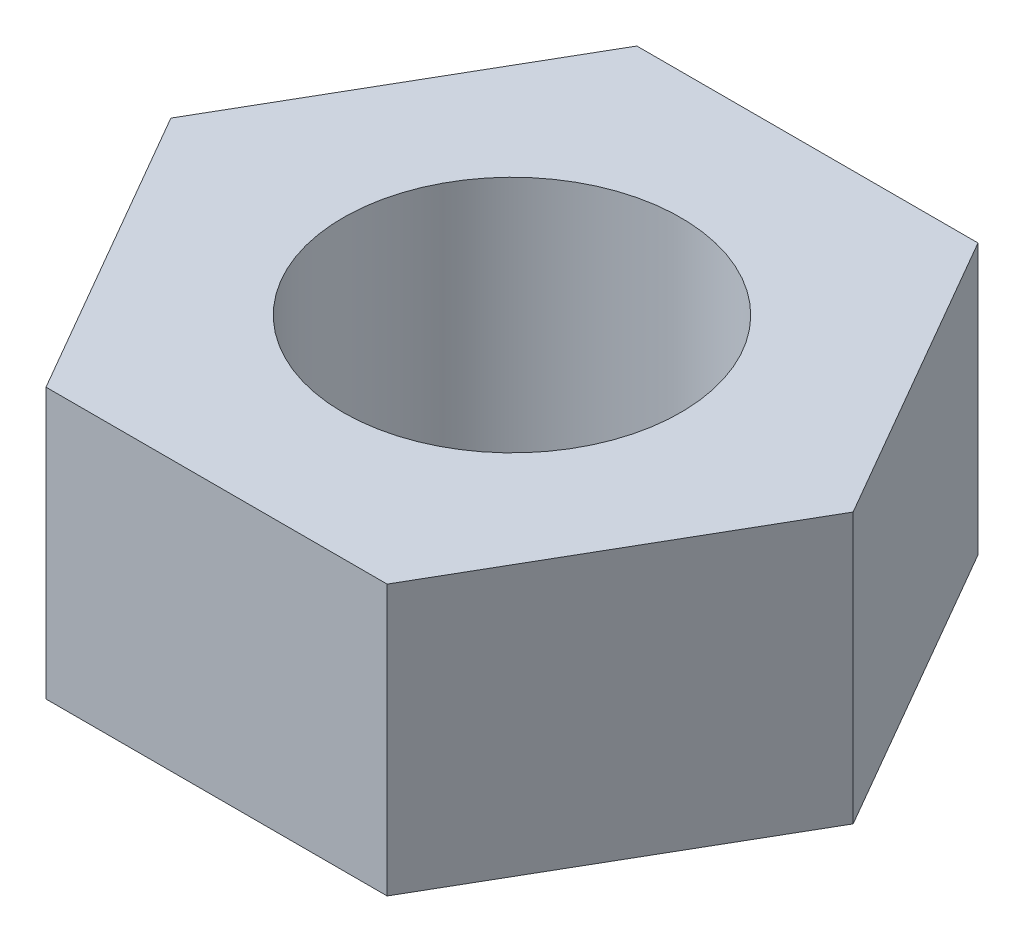
ISO-10303-21;
HEADER;
FILE_DESCRIPTION(('STEP AP214'),'2;1');
FILE_NAME('part.step','',(''),(''),'','','');
FILE_SCHEMA(('AUTOMOTIVE_DESIGN { 1 0 10303 214 1 1 1 1 }'));
ENDSEC;
DATA;
#1=APPLICATION_CONTEXT('core data for automotive mechanical design processes');
#2=APPLICATION_PROTOCOL_DEFINITION('international standard','automotive_design',2000,#1);
#3=PRODUCT_CONTEXT('',#1,'mechanical');
#4=PRODUCT('Part','Part','',(#3));
#5=PRODUCT_RELATED_PRODUCT_CATEGORY('part','',(#4));
#6=PRODUCT_DEFINITION_FORMATION('','',#4);
#7=PRODUCT_DEFINITION_CONTEXT('part definition',#1,'design');
#8=PRODUCT_DEFINITION('design','',#6,#7);
#9=PRODUCT_DEFINITION_SHAPE('','',#8);
#10=(LENGTH_UNIT() NAMED_UNIT(*) SI_UNIT(.MILLI.,.METRE.));
#11=(NAMED_UNIT(*) PLANE_ANGLE_UNIT() SI_UNIT($,.RADIAN.));
#12=(NAMED_UNIT(*) SI_UNIT($,.STERADIAN.) SOLID_ANGLE_UNIT());
#13=UNCERTAINTY_MEASURE_WITH_UNIT(LENGTH_MEASURE(1.E-05),#10,'distance_accuracy_value','');
#14=(GEOMETRIC_REPRESENTATION_CONTEXT(3) GLOBAL_UNCERTAINTY_ASSIGNED_CONTEXT((#13)) GLOBAL_UNIT_ASSIGNED_CONTEXT((#10,
#11,#12)) REPRESENTATION_CONTEXT('',''));
#15=CARTESIAN_POINT('',(0.,0.,0.));
#16=DIRECTION('',(0.,0.,1.));
#17=DIRECTION('',(1.,0.,0.));
#18=AXIS2_PLACEMENT_3D('',#15,#16,#17);
#19=CARTESIAN_POINT('',(-2.02072594216369,3.2,-3.5));
#20=DIRECTION('',(0.,1.,0.));
#21=DIRECTION('',(0.,0.,1.));
#22=AXIS2_PLACEMENT_3D('',#19,#20,#21);
#23=PLANE('',#22);
#24=DIRECTION('',(-1.,0.,0.));
#25=VECTOR('',#24,1.);
#26=CARTESIAN_POINT('',(2.02072594216369,3.2,-3.5));
#27=LINE('',#26,#25);
#28=CARTESIAN_POINT('',(2.02072594216369,3.2,-3.5));
#29=VERTEX_POINT('',#28);
#30=CARTESIAN_POINT('',(-2.02072594216369,3.2,-3.5));
#31=VERTEX_POINT('',#30);
#32=EDGE_CURVE('E132',#29,#31,#27,.T.);
#33=ORIENTED_EDGE('',*,*,#32,.T.);
#34=DIRECTION('',(-0.5,0.,0.866025403784439));
#35=VECTOR('',#34,1.);
#36=CARTESIAN_POINT('',(-2.02072594216369,3.2,-3.5));
#37=LINE('',#36,#35);
#38=CARTESIAN_POINT('',(-4.04145188432738,3.2,0.));
#39=VERTEX_POINT('',#38);
#40=EDGE_CURVE('E90',#31,#39,#37,.T.);
#41=ORIENTED_EDGE('',*,*,#40,.T.);
#42=DIRECTION('',(0.5,0.,0.866025403784439));
#43=VECTOR('',#42,1.);
#44=CARTESIAN_POINT('',(-4.04145188432738,3.2,0.));
#45=LINE('',#44,#43);
#46=CARTESIAN_POINT('',(-2.02072594216369,3.2,3.5));
#47=VERTEX_POINT('',#46);
#48=EDGE_CURVE('E103',#39,#47,#45,.T.);
#49=ORIENTED_EDGE('',*,*,#48,.T.);
#50=DIRECTION('',(1.,0.,0.));
#51=VECTOR('',#50,1.);
#52=CARTESIAN_POINT('',(-2.02072594216369,3.2,3.5));
#53=LINE('',#52,#51);
#54=CARTESIAN_POINT('',(2.02072594216369,3.2,3.5));
#55=VERTEX_POINT('',#54);
#56=EDGE_CURVE('E97',#47,#55,#53,.T.);
#57=ORIENTED_EDGE('',*,*,#56,.T.);
#58=DIRECTION('',(0.5,0.,-0.866025403784439));
#59=VECTOR('',#58,1.);
#60=CARTESIAN_POINT('',(2.02072594216369,3.2,3.5));
#61=LINE('',#60,#59);
#62=CARTESIAN_POINT('',(4.04145188432738,3.2,0.));
#63=VERTEX_POINT('',#62);
#64=EDGE_CURVE('E101',#55,#63,#61,.T.);
#65=ORIENTED_EDGE('',*,*,#64,.T.);
#66=DIRECTION('',(-0.5,0.,-0.866025403784439));
#67=VECTOR('',#66,1.);
#68=CARTESIAN_POINT('',(4.04145188432738,3.2,0.));
#69=LINE('',#68,#67);
#70=EDGE_CURVE('E53',#63,#29,#69,.T.);
#71=ORIENTED_EDGE('',*,*,#70,.T.);
#72=EDGE_LOOP('',(#33,#41,#49,#57,#65,#71));
#73=FACE_BOUND('',#72,.T.);
#74=CARTESIAN_POINT('',(0.,3.2,0.));
#75=DIRECTION('',(0.,1.,0.));
#76=DIRECTION('',(0.,0.,1.));
#77=AXIS2_PLACEMENT_3D('',#74,#75,#76);
#78=CIRCLE('',#77,2.);
#79=CARTESIAN_POINT('',(0.,3.2,2.));
#80=VERTEX_POINT('',#79);
#81=EDGE_CURVE('E125',#80,#80,#78,.T.);
#82=ORIENTED_EDGE('',*,*,#81,.F.);
#83=EDGE_LOOP('',(#82));
#84=FACE_BOUND('',#83,.T.);
#85=ADVANCED_FACE('F36',(#73,#84),#23,.T.);
#86=CARTESIAN_POINT('',(-2.02072594216369,0.,-3.5));
#87=DIRECTION('',(0.,1.,0.));
#88=DIRECTION('',(0.,0.,1.));
#89=AXIS2_PLACEMENT_3D('',#86,#87,#88);
#90=PLANE('',#89);
#91=DIRECTION('',(-1.,0.,0.));
#92=VECTOR('',#91,1.);
#93=CARTESIAN_POINT('',(2.02072594216369,0.,-3.5));
#94=LINE('',#93,#92);
#95=CARTESIAN_POINT('',(2.02072594216369,0.,-3.5));
#96=VERTEX_POINT('',#95);
#97=CARTESIAN_POINT('',(-2.02072594216369,0.,-3.5));
#98=VERTEX_POINT('',#97);
#99=EDGE_CURVE('E121',#96,#98,#94,.T.);
#100=ORIENTED_EDGE('',*,*,#99,.F.);
#101=DIRECTION('',(-0.5,0.,-0.866025403784439));
#102=VECTOR('',#101,1.);
#103=CARTESIAN_POINT('',(4.04145188432738,0.,0.));
#104=LINE('',#103,#102);
#105=CARTESIAN_POINT('',(4.04145188432738,0.,0.));
#106=VERTEX_POINT('',#105);
#107=EDGE_CURVE('E82',#106,#96,#104,.T.);
#108=ORIENTED_EDGE('',*,*,#107,.F.);
#109=DIRECTION('',(0.5,0.,-0.866025403784439));
#110=VECTOR('',#109,1.);
#111=CARTESIAN_POINT('',(2.02072594216369,0.,3.5));
#112=LINE('',#111,#110);
#113=CARTESIAN_POINT('',(2.02072594216369,0.,3.5));
#114=VERTEX_POINT('',#113);
#115=EDGE_CURVE('E76',#114,#106,#112,.T.);
#116=ORIENTED_EDGE('',*,*,#115,.F.);
#117=DIRECTION('',(1.,0.,0.));
#118=VECTOR('',#117,1.);
#119=CARTESIAN_POINT('',(-2.02072594216369,0.,3.5));
#120=LINE('',#119,#118);
#121=CARTESIAN_POINT('',(-2.02072594216369,0.,3.5));
#122=VERTEX_POINT('',#121);
#123=EDGE_CURVE('E111',#122,#114,#120,.T.);
#124=ORIENTED_EDGE('',*,*,#123,.F.);
#125=DIRECTION('',(0.5,0.,0.866025403784439));
#126=VECTOR('',#125,1.);
#127=CARTESIAN_POINT('',(-4.04145188432738,0.,0.));
#128=LINE('',#127,#126);
#129=CARTESIAN_POINT('',(-4.04145188432738,0.,0.));
#130=VERTEX_POINT('',#129);
#131=EDGE_CURVE('E127',#130,#122,#128,.T.);
#132=ORIENTED_EDGE('',*,*,#131,.F.);
#133=DIRECTION('',(-0.5,0.,0.866025403784439));
#134=VECTOR('',#133,1.);
#135=CARTESIAN_POINT('',(-2.02072594216369,0.,-3.5));
#136=LINE('',#135,#134);
#137=EDGE_CURVE('E124',#98,#130,#136,.T.);
#138=ORIENTED_EDGE('',*,*,#137,.F.);
#139=EDGE_LOOP('',(#100,#108,#116,#124,#132,#138));
#140=FACE_BOUND('',#139,.T.);
#141=CARTESIAN_POINT('',(0.,0.,0.));
#142=DIRECTION('',(0.,1.,0.));
#143=DIRECTION('',(0.,0.,1.));
#144=AXIS2_PLACEMENT_3D('',#141,#142,#143);
#145=CIRCLE('',#144,2.);
#146=CARTESIAN_POINT('',(0.,0.,2.));
#147=VERTEX_POINT('',#146);
#148=EDGE_CURVE('E225',#147,#147,#145,.T.);
#149=ORIENTED_EDGE('',*,*,#148,.T.);
#150=EDGE_LOOP('',(#149));
#151=FACE_BOUND('',#150,.T.);
#152=ADVANCED_FACE('F141',(#140,#151),#90,.F.);
#153=CARTESIAN_POINT('',(2.02072594216369,3.2,-3.5));
#154=DIRECTION('',(0.,0.,1.));
#155=DIRECTION('',(1.,0.,0.));
#156=AXIS2_PLACEMENT_3D('',#153,#154,#155);
#157=PLANE('',#156);
#158=ORIENTED_EDGE('',*,*,#99,.T.);
#159=DIRECTION('',(0.,-1.,0.));
#160=VECTOR('',#159,1.);
#161=CARTESIAN_POINT('',(-2.02072594216369,3.2,-3.5));
#162=LINE('',#161,#160);
#163=EDGE_CURVE('E11',#31,#98,#162,.T.);
#164=ORIENTED_EDGE('',*,*,#163,.F.);
#165=ORIENTED_EDGE('',*,*,#32,.F.);
#166=DIRECTION('',(0.,-1.,0.));
#167=VECTOR('',#166,1.);
#168=CARTESIAN_POINT('',(2.02072594216369,3.2,-3.5));
#169=LINE('',#168,#167);
#170=EDGE_CURVE('E117',#29,#96,#169,.T.);
#171=ORIENTED_EDGE('',*,*,#170,.T.);
#172=EDGE_LOOP('',(#158,#164,#165,#171));
#173=FACE_BOUND('',#172,.T.);
#174=ADVANCED_FACE('F38',(#173),#157,.F.);
#175=CARTESIAN_POINT('',(-2.02072594216369,3.2,-3.5));
#176=DIRECTION('',(0.866025403784439,0.,0.5));
#177=DIRECTION('',(0.5,0.,-0.866025403784439));
#178=AXIS2_PLACEMENT_3D('',#175,#176,#177);
#179=PLANE('',#178);
#180=ORIENTED_EDGE('',*,*,#137,.T.);
#181=DIRECTION('',(0.,-1.,0.));
#182=VECTOR('',#181,1.);
#183=CARTESIAN_POINT('',(-4.04145188432738,3.2,0.));
#184=LINE('',#183,#182);
#185=EDGE_CURVE('E45',#39,#130,#184,.T.);
#186=ORIENTED_EDGE('',*,*,#185,.F.);
#187=ORIENTED_EDGE('',*,*,#40,.F.);
#188=ORIENTED_EDGE('',*,*,#163,.T.);
#189=EDGE_LOOP('',(#180,#186,#187,#188));
#190=FACE_BOUND('',#189,.T.);
#191=ADVANCED_FACE('F166',(#190),#179,.F.);
#192=CARTESIAN_POINT('',(-4.04145188432738,3.2,0.));
#193=DIRECTION('',(0.866025403784439,0.,-0.5));
#194=DIRECTION('',(-0.5,0.,-0.866025403784439));
#195=AXIS2_PLACEMENT_3D('',#192,#193,#194);
#196=PLANE('',#195);
#197=ORIENTED_EDGE('',*,*,#131,.T.);
#198=DIRECTION('',(0.,-1.,0.));
#199=VECTOR('',#198,1.);
#200=CARTESIAN_POINT('',(-2.02072594216369,3.2,3.5));
#201=LINE('',#200,#199);
#202=EDGE_CURVE('E112',#47,#122,#201,.T.);
#203=ORIENTED_EDGE('',*,*,#202,.F.);
#204=ORIENTED_EDGE('',*,*,#48,.F.);
#205=ORIENTED_EDGE('',*,*,#185,.T.);
#206=EDGE_LOOP('',(#197,#203,#204,#205));
#207=FACE_BOUND('',#206,.T.);
#208=ADVANCED_FACE('F138',(#207),#196,.F.);
#209=CARTESIAN_POINT('',(-2.02072594216369,3.2,3.5));
#210=DIRECTION('',(0.,0.,-1.));
#211=DIRECTION('',(-1.,0.,0.));
#212=AXIS2_PLACEMENT_3D('',#209,#210,#211);
#213=PLANE('',#212);
#214=ORIENTED_EDGE('',*,*,#123,.T.);
#215=DIRECTION('',(0.,-1.,0.));
#216=VECTOR('',#215,1.);
#217=CARTESIAN_POINT('',(2.02072594216369,3.2,3.5));
#218=LINE('',#217,#216);
#219=EDGE_CURVE('E108',#55,#114,#218,.T.);
#220=ORIENTED_EDGE('',*,*,#219,.F.);
#221=ORIENTED_EDGE('',*,*,#56,.F.);
#222=ORIENTED_EDGE('',*,*,#202,.T.);
#223=EDGE_LOOP('',(#214,#220,#221,#222));
#224=FACE_BOUND('',#223,.T.);
#225=ADVANCED_FACE('F109',(#224),#213,.F.);
#226=CARTESIAN_POINT('',(2.02072594216369,3.2,3.5));
#227=DIRECTION('',(-0.866025403784439,0.,-0.5));
#228=DIRECTION('',(-0.5,0.,0.866025403784439));
#229=AXIS2_PLACEMENT_3D('',#226,#227,#228);
#230=PLANE('',#229);
#231=ORIENTED_EDGE('',*,*,#115,.T.);
#232=DIRECTION('',(0.,-1.,0.));
#233=VECTOR('',#232,1.);
#234=CARTESIAN_POINT('',(4.04145188432738,3.2,0.));
#235=LINE('',#234,#233);
#236=EDGE_CURVE('E113',#63,#106,#235,.T.);
#237=ORIENTED_EDGE('',*,*,#236,.F.);
#238=ORIENTED_EDGE('',*,*,#64,.F.);
#239=ORIENTED_EDGE('',*,*,#219,.T.);
#240=EDGE_LOOP('',(#231,#237,#238,#239));
#241=FACE_BOUND('',#240,.T.);
#242=ADVANCED_FACE('F115',(#241),#230,.F.);
#243=CARTESIAN_POINT('',(4.04145188432738,3.2,0.));
#244=DIRECTION('',(-0.866025403784439,0.,0.5));
#245=DIRECTION('',(0.5,0.,0.866025403784439));
#246=AXIS2_PLACEMENT_3D('',#243,#244,#245);
#247=PLANE('',#246);
#248=ORIENTED_EDGE('',*,*,#107,.T.);
#249=ORIENTED_EDGE('',*,*,#170,.F.);
#250=ORIENTED_EDGE('',*,*,#70,.F.);
#251=ORIENTED_EDGE('',*,*,#236,.T.);
#252=EDGE_LOOP('',(#248,#249,#250,#251));
#253=FACE_BOUND('',#252,.T.);
#254=ADVANCED_FACE('F146',(#253),#247,.F.);
#255=CARTESIAN_POINT('',(0.,3.2,0.));
#256=DIRECTION('',(0.,-1.,0.));
#257=DIRECTION('',(0.,0.,-1.));
#258=AXIS2_PLACEMENT_3D('',#255,#256,#257);
#259=CYLINDRICAL_SURFACE('',#258,2.);
#260=ORIENTED_EDGE('',*,*,#81,.T.);
#261=EDGE_LOOP('',(#260));
#262=FACE_BOUND('',#261,.T.);
#263=ORIENTED_EDGE('',*,*,#148,.F.);
#264=EDGE_LOOP('',(#263));
#265=FACE_BOUND('',#264,.T.);
#266=ADVANCED_FACE('F148',(#262,#265),#259,.F.);
#267=CLOSED_SHELL('',(#85,#152,#174,#191,#208,#225,#242,#254,#266));
#268=MANIFOLD_SOLID_BREP('B2',#267);
#269=ADVANCED_BREP_SHAPE_REPRESENTATION('',(#18,#268),#14);
#270=SHAPE_DEFINITION_REPRESENTATION(#9,#269);
ENDSEC;
END-ISO-10303-21;
